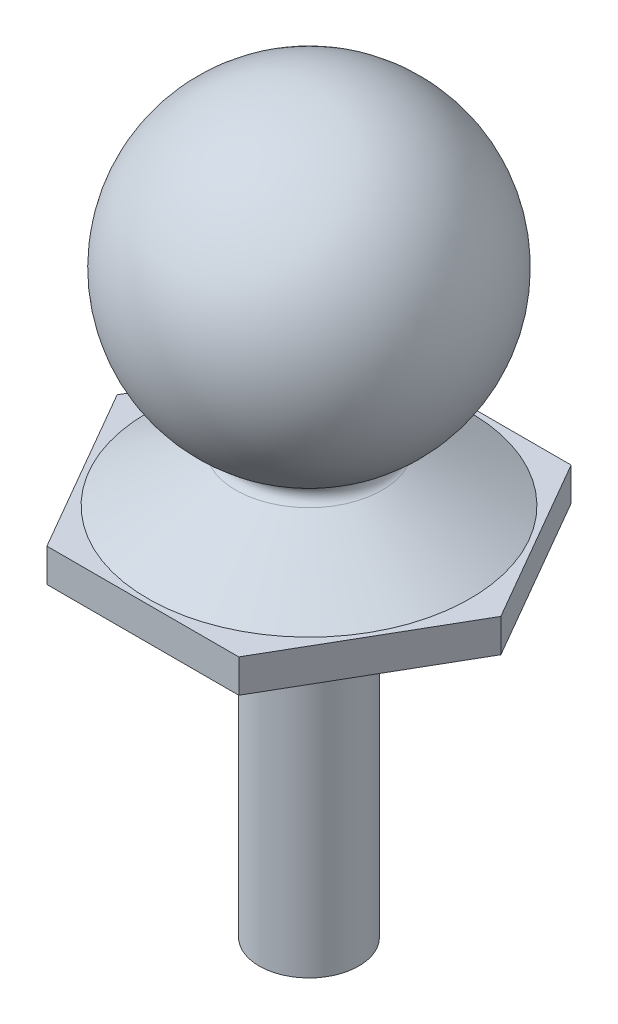
ISO-10303-21;
HEADER;
FILE_DESCRIPTION(('STEP AP214'),'2;1');
FILE_NAME('part.step','',(''),(''),'','','');
FILE_SCHEMA(('AUTOMOTIVE_DESIGN { 1 0 10303 214 1 1 1 1 }'));
ENDSEC;
DATA;
#1=APPLICATION_CONTEXT('core data for automotive mechanical design processes');
#2=APPLICATION_PROTOCOL_DEFINITION('international standard','automotive_design',2000,#1);
#3=PRODUCT_CONTEXT('',#1,'mechanical');
#4=PRODUCT('Part','Part','',(#3));
#5=PRODUCT_RELATED_PRODUCT_CATEGORY('part','',(#4));
#6=PRODUCT_DEFINITION_FORMATION('','',#4);
#7=PRODUCT_DEFINITION_CONTEXT('part definition',#1,'design');
#8=PRODUCT_DEFINITION('design','',#6,#7);
#9=PRODUCT_DEFINITION_SHAPE('','',#8);
#10=(LENGTH_UNIT() NAMED_UNIT(*) SI_UNIT(.MILLI.,.METRE.));
#11=(NAMED_UNIT(*) PLANE_ANGLE_UNIT() SI_UNIT($,.RADIAN.));
#12=(NAMED_UNIT(*) SI_UNIT($,.STERADIAN.) SOLID_ANGLE_UNIT());
#13=UNCERTAINTY_MEASURE_WITH_UNIT(LENGTH_MEASURE(1.E-05),#10,'distance_accuracy_value','');
#14=(GEOMETRIC_REPRESENTATION_CONTEXT(3) GLOBAL_UNCERTAINTY_ASSIGNED_CONTEXT((#13)) GLOBAL_UNIT_ASSIGNED_CONTEXT((#10,
#11,#12)) REPRESENTATION_CONTEXT('',''));
#15=CARTESIAN_POINT('',(0.,0.,0.));
#16=DIRECTION('',(0.,0.,1.));
#17=DIRECTION('',(1.,0.,0.));
#18=AXIS2_PLACEMENT_3D('',#15,#16,#17);
#19=CARTESIAN_POINT('',(0.,-4.43691260265973,0.));
#20=DIRECTION('',(0.,1.,0.));
#21=DIRECTION('',(-1.,0.,0.));
#22=AXIS2_PLACEMENT_3D('',#19,#20,#21);
#23=TOROIDAL_SURFACE('',#22,2.35436537108675,0.313369729864637);
#24=CARTESIAN_POINT('',(0.,-4.1642004470709,0.));
#25=DIRECTION('',(0.,1.,0.));
#26=DIRECTION('',(-1.,0.,0.));
#27=AXIS2_PLACEMENT_3D('',#24,#25,#26);
#28=CIRCLE('',#27,2.20000000000395);
#29=CARTESIAN_POINT('',(-2.20000000000395,-4.1642004470709,0.));
#30=VERTEX_POINT('',#29);
#31=EDGE_CURVE('E140',#30,#30,#28,.T.);
#32=ORIENTED_EDGE('',*,*,#31,.F.);
#33=EDGE_LOOP('',(#32));
#34=FACE_BOUND('',#33,.T.);
#35=CARTESIAN_POINT('',(0.,-4.70962475824633,0.));
#36=DIRECTION('',(0.,1.,0.));
#37=DIRECTION('',(-1.,0.,0.));
#38=AXIS2_PLACEMENT_3D('',#35,#36,#37);
#39=CIRCLE('',#38,2.2);
#40=CARTESIAN_POINT('',(-2.2,-4.70962475824633,0.));
#41=VERTEX_POINT('',#40);
#42=EDGE_CURVE('E11',#41,#41,#39,.T.);
#43=ORIENTED_EDGE('',*,*,#42,.T.);
#44=EDGE_LOOP('',(#43));
#45=FACE_BOUND('',#44,.T.);
#46=ADVANCED_FACE('F34',(#34,#45),#23,.F.);
#47=CARTESIAN_POINT('',(0.,-6.20962475824633,0.));
#48=DIRECTION('',(0.,-1.,0.));
#49=DIRECTION('',(1.,0.,0.));
#50=AXIS2_PLACEMENT_3D('',#47,#48,#49);
#51=CONICAL_SURFACE('',#50,4.85,1.05572350977611);
#52=ORIENTED_EDGE('',*,*,#42,.F.);
#53=EDGE_LOOP('',(#52));
#54=FACE_BOUND('',#53,.T.);
#55=CARTESIAN_POINT('',(0.,-6.20962475824633,0.));
#56=DIRECTION('',(0.,1.,0.));
#57=DIRECTION('',(-1.,0.,0.));
#58=AXIS2_PLACEMENT_3D('',#55,#56,#57);
#59=CIRCLE('',#58,4.85);
#60=CARTESIAN_POINT('',(-4.85,-6.20962475824633,0.));
#61=VERTEX_POINT('',#60);
#62=EDGE_CURVE('E43',#61,#61,#59,.T.);
#63=ORIENTED_EDGE('',*,*,#62,.T.);
#64=EDGE_LOOP('',(#63));
#65=FACE_BOUND('',#64,.T.);
#66=ADVANCED_FACE('F162',(#54,#65),#51,.T.);
#67=CARTESIAN_POINT('',(4.85,-6.20962475824633,0.));
#68=DIRECTION('',(0.,-1.,0.));
#69=DIRECTION('',(1.,0.,0.));
#70=AXIS2_PLACEMENT_3D('',#67,#68,#69);
#71=PLANE('',#70);
#72=ORIENTED_EDGE('',*,*,#62,.F.);
#73=EDGE_LOOP('',(#72));
#74=FACE_BOUND('',#73,.T.);
#75=DIRECTION('',(0.5,0.,-0.866025403784438));
#76=VECTOR('',#75,1.);
#77=CARTESIAN_POINT('',(-5.77350269189626,-6.20962475824633,0.));
#78=LINE('',#77,#76);
#79=CARTESIAN_POINT('',(-5.77350269189626,-6.20962475824633,0.));
#80=VERTEX_POINT('',#79);
#81=CARTESIAN_POINT('',(-2.88675134594813,-6.20962475824633,-5.00000000000001));
#82=VERTEX_POINT('',#81);
#83=EDGE_CURVE('E107',#80,#82,#78,.T.);
#84=ORIENTED_EDGE('',*,*,#83,.F.);
#85=DIRECTION('',(-0.5,0.,-0.866025403784439));
#86=VECTOR('',#85,1.);
#87=CARTESIAN_POINT('',(-2.88675134594813,-6.20962475824633,5.00000000000001));
#88=LINE('',#87,#86);
#89=CARTESIAN_POINT('',(-2.88675134594813,-6.20962475824633,5.00000000000001));
#90=VERTEX_POINT('',#89);
#91=EDGE_CURVE('E96',#90,#80,#88,.T.);
#92=ORIENTED_EDGE('',*,*,#91,.F.);
#93=DIRECTION('',(-1.,0.,0.));
#94=VECTOR('',#93,1.);
#95=CARTESIAN_POINT('',(2.88675134594813,-6.20962475824633,5.00000000000001));
#96=LINE('',#95,#94);
#97=CARTESIAN_POINT('',(2.88675134594813,-6.20962475824633,5.00000000000001));
#98=VERTEX_POINT('',#97);
#99=EDGE_CURVE('E108',#98,#90,#96,.T.);
#100=ORIENTED_EDGE('',*,*,#99,.F.);
#101=DIRECTION('',(-0.5,0.,0.866025403784439));
#102=VECTOR('',#101,1.);
#103=CARTESIAN_POINT('',(5.77350269189626,-6.20962475824633,0.));
#104=LINE('',#103,#102);
#105=CARTESIAN_POINT('',(5.77350269189626,-6.20962475824633,0.));
#106=VERTEX_POINT('',#105);
#107=EDGE_CURVE('E297',#106,#98,#104,.T.);
#108=ORIENTED_EDGE('',*,*,#107,.F.);
#109=DIRECTION('',(0.5,0.,0.866025403784439));
#110=VECTOR('',#109,1.);
#111=CARTESIAN_POINT('',(2.88675134594813,-6.20962475824633,-5.00000000000001));
#112=LINE('',#111,#110);
#113=CARTESIAN_POINT('',(2.88675134594813,-6.20962475824633,-5.00000000000001));
#114=VERTEX_POINT('',#113);
#115=EDGE_CURVE('E84',#114,#106,#112,.T.);
#116=ORIENTED_EDGE('',*,*,#115,.F.);
#117=DIRECTION('',(1.,0.,0.));
#118=VECTOR('',#117,1.);
#119=CARTESIAN_POINT('',(-2.88675134594813,-6.20962475824633,-5.00000000000001));
#120=LINE('',#119,#118);
#121=EDGE_CURVE('E51',#82,#114,#120,.T.);
#122=ORIENTED_EDGE('',*,*,#121,.F.);
#123=EDGE_LOOP('',(#84,#92,#100,#108,#116,#122));
#124=FACE_BOUND('',#123,.T.);
#125=ADVANCED_FACE('F115',(#74,#124),#71,.F.);
#126=CARTESIAN_POINT('',(0.,0.,0.));
#127=DIRECTION('',(0.,1.,0.));
#128=DIRECTION('',(1.,0.,0.));
#129=AXIS2_PLACEMENT_3D('',#126,#127,#128);
#130=SPHERICAL_SURFACE('',#129,4.70962475823742);
#131=ORIENTED_EDGE('',*,*,#31,.T.);
#132=EDGE_LOOP('',(#131));
#133=FACE_BOUND('',#132,.T.);
#134=ADVANCED_FACE('F165',(#133),#130,.T.);
#135=CARTESIAN_POINT('',(2.88675134594813,-6.20962475824633,-5.00000000000001));
#136=DIRECTION('',(0.866025403784439,0.,-0.5));
#137=DIRECTION('',(-0.5,0.,-0.866025403784439));
#138=AXIS2_PLACEMENT_3D('',#135,#136,#137);
#139=PLANE('',#138);
#140=ORIENTED_EDGE('',*,*,#115,.T.);
#141=DIRECTION('',(0.,-1.,0.));
#142=VECTOR('',#141,1.);
#143=CARTESIAN_POINT('',(5.77350269189626,-6.20962475824633,0.));
#144=LINE('',#143,#142);
#145=CARTESIAN_POINT('',(5.77350269189626,-7.20962475824633,0.));
#146=VERTEX_POINT('',#145);
#147=EDGE_CURVE('E120',#106,#146,#144,.T.);
#148=ORIENTED_EDGE('',*,*,#147,.T.);
#149=DIRECTION('',(0.5,0.,0.866025403784439));
#150=VECTOR('',#149,1.);
#151=CARTESIAN_POINT('',(2.88675134594813,-7.20962475824633,-5.00000000000001));
#152=LINE('',#151,#150);
#153=CARTESIAN_POINT('',(2.88675134594813,-7.20962475824633,-5.00000000000001));
#154=VERTEX_POINT('',#153);
#155=EDGE_CURVE('E124',#154,#146,#152,.T.);
#156=ORIENTED_EDGE('',*,*,#155,.F.);
#157=DIRECTION('',(0.,-1.,0.));
#158=VECTOR('',#157,1.);
#159=CARTESIAN_POINT('',(2.88675134594813,-6.20962475824633,-5.00000000000001));
#160=LINE('',#159,#158);
#161=EDGE_CURVE('E138',#114,#154,#160,.T.);
#162=ORIENTED_EDGE('',*,*,#161,.F.);
#163=EDGE_LOOP('',(#140,#148,#156,#162));
#164=FACE_BOUND('',#163,.T.);
#165=ADVANCED_FACE('F171',(#164),#139,.T.);
#166=CARTESIAN_POINT('',(-2.88675134594813,-6.20962475824633,-5.00000000000001));
#167=DIRECTION('',(0.,0.,-1.));
#168=DIRECTION('',(-1.,0.,0.));
#169=AXIS2_PLACEMENT_3D('',#166,#167,#168);
#170=PLANE('',#169);
#171=ORIENTED_EDGE('',*,*,#121,.T.);
#172=ORIENTED_EDGE('',*,*,#161,.T.);
#173=DIRECTION('',(1.,0.,0.));
#174=VECTOR('',#173,1.);
#175=CARTESIAN_POINT('',(-2.88675134594813,-7.20962475824633,-5.00000000000001));
#176=LINE('',#175,#174);
#177=CARTESIAN_POINT('',(-2.88675134594813,-7.20962475824633,-5.00000000000001));
#178=VERTEX_POINT('',#177);
#179=EDGE_CURVE('E77',#178,#154,#176,.T.);
#180=ORIENTED_EDGE('',*,*,#179,.F.);
#181=DIRECTION('',(0.,-1.,0.));
#182=VECTOR('',#181,1.);
#183=CARTESIAN_POINT('',(-2.88675134594813,-6.20962475824633,-5.00000000000001));
#184=LINE('',#183,#182);
#185=EDGE_CURVE('E113',#82,#178,#184,.T.);
#186=ORIENTED_EDGE('',*,*,#185,.F.);
#187=EDGE_LOOP('',(#171,#172,#180,#186));
#188=FACE_BOUND('',#187,.T.);
#189=ADVANCED_FACE('F231',(#188),#170,.T.);
#190=CARTESIAN_POINT('',(-5.77350269189626,-6.20962475824633,0.));
#191=DIRECTION('',(-0.866025403784439,0.,-0.5));
#192=DIRECTION('',(-0.5,0.,0.866025403784439));
#193=AXIS2_PLACEMENT_3D('',#190,#191,#192);
#194=PLANE('',#193);
#195=ORIENTED_EDGE('',*,*,#83,.T.);
#196=ORIENTED_EDGE('',*,*,#185,.T.);
#197=DIRECTION('',(0.5,0.,-0.866025403784438));
#198=VECTOR('',#197,1.);
#199=CARTESIAN_POINT('',(-5.77350269189626,-7.20962475824633,0.));
#200=LINE('',#199,#198);
#201=CARTESIAN_POINT('',(-5.77350269189626,-7.20962475824633,0.));
#202=VERTEX_POINT('',#201);
#203=EDGE_CURVE('E74',#202,#178,#200,.T.);
#204=ORIENTED_EDGE('',*,*,#203,.F.);
#205=DIRECTION('',(0.,-1.,0.));
#206=VECTOR('',#205,1.);
#207=CARTESIAN_POINT('',(-5.77350269189626,-6.20962475824633,0.));
#208=LINE('',#207,#206);
#209=EDGE_CURVE('E100',#80,#202,#208,.T.);
#210=ORIENTED_EDGE('',*,*,#209,.F.);
#211=EDGE_LOOP('',(#195,#196,#204,#210));
#212=FACE_BOUND('',#211,.T.);
#213=ADVANCED_FACE('F111',(#212),#194,.T.);
#214=CARTESIAN_POINT('',(-2.88675134594813,-6.20962475824633,5.00000000000001));
#215=DIRECTION('',(-0.866025403784439,0.,0.5));
#216=DIRECTION('',(0.5,0.,0.866025403784439));
#217=AXIS2_PLACEMENT_3D('',#214,#215,#216);
#218=PLANE('',#217);
#219=ORIENTED_EDGE('',*,*,#91,.T.);
#220=ORIENTED_EDGE('',*,*,#209,.T.);
#221=DIRECTION('',(-0.5,0.,-0.866025403784439));
#222=VECTOR('',#221,1.);
#223=CARTESIAN_POINT('',(-2.88675134594813,-7.20962475824633,5.00000000000001));
#224=LINE('',#223,#222);
#225=CARTESIAN_POINT('',(-2.88675134594813,-7.20962475824633,5.00000000000001));
#226=VERTEX_POINT('',#225);
#227=EDGE_CURVE('E132',#226,#202,#224,.T.);
#228=ORIENTED_EDGE('',*,*,#227,.F.);
#229=DIRECTION('',(0.,-1.,0.));
#230=VECTOR('',#229,1.);
#231=CARTESIAN_POINT('',(-2.88675134594813,-6.20962475824633,5.00000000000001));
#232=LINE('',#231,#230);
#233=EDGE_CURVE('E102',#90,#226,#232,.T.);
#234=ORIENTED_EDGE('',*,*,#233,.F.);
#235=EDGE_LOOP('',(#219,#220,#228,#234));
#236=FACE_BOUND('',#235,.T.);
#237=ADVANCED_FACE('F98',(#236),#218,.T.);
#238=CARTESIAN_POINT('',(2.88675134594813,-6.20962475824633,5.00000000000001));
#239=DIRECTION('',(0.,0.,1.));
#240=DIRECTION('',(1.,0.,0.));
#241=AXIS2_PLACEMENT_3D('',#238,#239,#240);
#242=PLANE('',#241);
#243=ORIENTED_EDGE('',*,*,#99,.T.);
#244=ORIENTED_EDGE('',*,*,#233,.T.);
#245=DIRECTION('',(-1.,0.,0.));
#246=VECTOR('',#245,1.);
#247=CARTESIAN_POINT('',(2.88675134594813,-7.20962475824633,5.00000000000001));
#248=LINE('',#247,#246);
#249=CARTESIAN_POINT('',(2.88675134594813,-7.20962475824633,5.00000000000001));
#250=VERTEX_POINT('',#249);
#251=EDGE_CURVE('E129',#250,#226,#248,.T.);
#252=ORIENTED_EDGE('',*,*,#251,.F.);
#253=DIRECTION('',(0.,-1.,0.));
#254=VECTOR('',#253,1.);
#255=CARTESIAN_POINT('',(2.88675134594813,-6.20962475824633,5.00000000000001));
#256=LINE('',#255,#254);
#257=EDGE_CURVE('E144',#98,#250,#256,.T.);
#258=ORIENTED_EDGE('',*,*,#257,.F.);
#259=EDGE_LOOP('',(#243,#244,#252,#258));
#260=FACE_BOUND('',#259,.T.);
#261=ADVANCED_FACE('F256',(#260),#242,.T.);
#262=CARTESIAN_POINT('',(5.77350269189626,-6.20962475824633,0.));
#263=DIRECTION('',(0.866025403784439,0.,0.5));
#264=DIRECTION('',(0.5,0.,-0.866025403784439));
#265=AXIS2_PLACEMENT_3D('',#262,#263,#264);
#266=PLANE('',#265);
#267=ORIENTED_EDGE('',*,*,#107,.T.);
#268=ORIENTED_EDGE('',*,*,#257,.T.);
#269=DIRECTION('',(-0.5,0.,0.866025403784439));
#270=VECTOR('',#269,1.);
#271=CARTESIAN_POINT('',(5.77350269189626,-7.20962475824633,0.));
#272=LINE('',#271,#270);
#273=EDGE_CURVE('E126',#146,#250,#272,.T.);
#274=ORIENTED_EDGE('',*,*,#273,.F.);
#275=ORIENTED_EDGE('',*,*,#147,.F.);
#276=EDGE_LOOP('',(#267,#268,#274,#275));
#277=FACE_BOUND('',#276,.T.);
#278=ADVANCED_FACE('F210',(#277),#266,.T.);
#279=CARTESIAN_POINT('',(0.,-17.4596247582463,0.));
#280=DIRECTION('',(0.,1.,0.));
#281=DIRECTION('',(-1.,0.,0.));
#282=AXIS2_PLACEMENT_3D('',#279,#280,#281);
#283=PLANE('',#282);
#284=CARTESIAN_POINT('',(0.,-17.4596247582463,0.));
#285=DIRECTION('',(0.,1.,0.));
#286=DIRECTION('',(-1.,0.,0.));
#287=AXIS2_PLACEMENT_3D('',#284,#285,#286);
#288=CIRCLE('',#287,1.5);
#289=CARTESIAN_POINT('',(-1.5,-17.4596247582463,0.));
#290=VERTEX_POINT('',#289);
#291=EDGE_CURVE('E150',#290,#290,#288,.T.);
#292=ORIENTED_EDGE('',*,*,#291,.F.);
#293=EDGE_LOOP('',(#292));
#294=FACE_BOUND('',#293,.T.);
#295=ADVANCED_FACE('F199',(#294),#283,.F.);
#296=CARTESIAN_POINT('',(0.,4.70962475823742,0.));
#297=DIRECTION('',(0.,1.,0.));
#298=DIRECTION('',(-1.,0.,0.));
#299=AXIS2_PLACEMENT_3D('',#296,#297,#298);
#300=CYLINDRICAL_SURFACE('',#299,1.5);
#301=CARTESIAN_POINT('',(0.,-7.20962475824632,0.));
#302=DIRECTION('',(0.,1.,0.));
#303=DIRECTION('',(-1.,0.,0.));
#304=AXIS2_PLACEMENT_3D('',#301,#302,#303);
#305=CIRCLE('',#304,1.5);
#306=CARTESIAN_POINT('',(-1.5,-7.20962475824632,0.));
#307=VERTEX_POINT('',#306);
#308=EDGE_CURVE('E153',#307,#307,#305,.T.);
#309=ORIENTED_EDGE('',*,*,#308,.F.);
#310=EDGE_LOOP('',(#309));
#311=FACE_BOUND('',#310,.T.);
#312=ORIENTED_EDGE('',*,*,#291,.T.);
#313=EDGE_LOOP('',(#312));
#314=FACE_BOUND('',#313,.T.);
#315=ADVANCED_FACE('F193',(#311,#314),#300,.T.);
#316=CARTESIAN_POINT('',(1.5,-7.20962475824633,0.));
#317=DIRECTION('',(0.,1.,0.));
#318=DIRECTION('',(-1.,0.,0.));
#319=AXIS2_PLACEMENT_3D('',#316,#317,#318);
#320=PLANE('',#319);
#321=ORIENTED_EDGE('',*,*,#203,.T.);
#322=ORIENTED_EDGE('',*,*,#179,.T.);
#323=ORIENTED_EDGE('',*,*,#155,.T.);
#324=ORIENTED_EDGE('',*,*,#273,.T.);
#325=ORIENTED_EDGE('',*,*,#251,.T.);
#326=ORIENTED_EDGE('',*,*,#227,.T.);
#327=EDGE_LOOP('',(#321,#322,#323,#324,#325,#326));
#328=FACE_BOUND('',#327,.T.);
#329=ORIENTED_EDGE('',*,*,#308,.T.);
#330=EDGE_LOOP('',(#329));
#331=FACE_BOUND('',#330,.T.);
#332=ADVANCED_FACE('F198',(#328,#331),#320,.F.);
#333=CLOSED_SHELL('',(#46,#66,#125,#134,#165,#189,#213,#237,#261,#278,#295,#315,#332));
#334=MANIFOLD_SOLID_BREP('B2',#333);
#335=ADVANCED_BREP_SHAPE_REPRESENTATION('',(#18,#334),#14);
#336=SHAPE_DEFINITION_REPRESENTATION(#9,#335);
ENDSEC;
END-ISO-10303-21;
